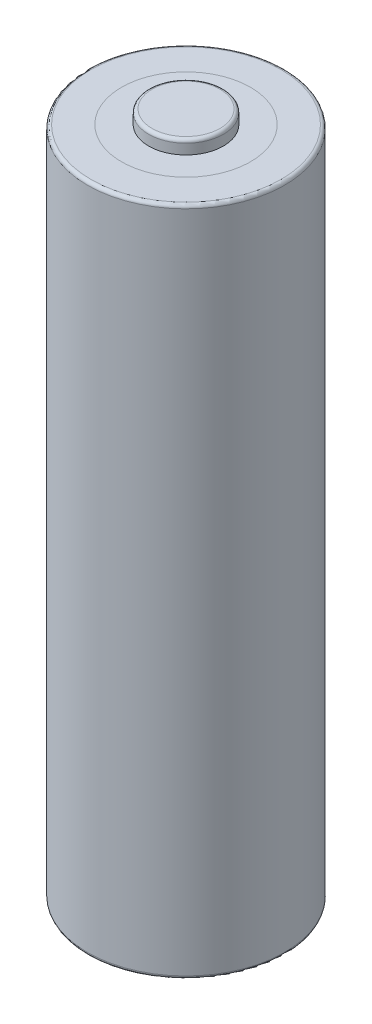
ISO-10303-21;
HEADER;
FILE_DESCRIPTION(('STEP AP214'),'2;1');
FILE_NAME('part.step','',(''),(''),'','','');
FILE_SCHEMA(('AUTOMOTIVE_DESIGN { 1 0 10303 214 1 1 1 1 }'));
ENDSEC;
DATA;
#1=APPLICATION_CONTEXT('core data for automotive mechanical design processes');
#2=APPLICATION_PROTOCOL_DEFINITION('international standard','automotive_design',2000,#1);
#3=PRODUCT_CONTEXT('',#1,'mechanical');
#4=PRODUCT('Part','Part','',(#3));
#5=PRODUCT_RELATED_PRODUCT_CATEGORY('part','',(#4));
#6=PRODUCT_DEFINITION_FORMATION('','',#4);
#7=PRODUCT_DEFINITION_CONTEXT('part definition',#1,'design');
#8=PRODUCT_DEFINITION('design','',#6,#7);
#9=PRODUCT_DEFINITION_SHAPE('','',#8);
#10=(LENGTH_UNIT() NAMED_UNIT(*) SI_UNIT(.MILLI.,.METRE.));
#11=(NAMED_UNIT(*) PLANE_ANGLE_UNIT() SI_UNIT($,.RADIAN.));
#12=(NAMED_UNIT(*) SI_UNIT($,.STERADIAN.) SOLID_ANGLE_UNIT());
#13=UNCERTAINTY_MEASURE_WITH_UNIT(LENGTH_MEASURE(1.E-05),#10,'distance_accuracy_value','');
#14=(GEOMETRIC_REPRESENTATION_CONTEXT(3) GLOBAL_UNCERTAINTY_ASSIGNED_CONTEXT((#13)) GLOBAL_UNIT_ASSIGNED_CONTEXT((#10,
#11,#12)) REPRESENTATION_CONTEXT('',''));
#15=CARTESIAN_POINT('',(0.,0.,0.));
#16=DIRECTION('',(0.,0.,1.));
#17=DIRECTION('',(1.,0.,0.));
#18=AXIS2_PLACEMENT_3D('',#15,#16,#17);
#19=CARTESIAN_POINT('',(0.,0.1,-7.));
#20=DIRECTION('',(0.,1.,0.));
#21=DIRECTION('',(0.,0.,1.));
#22=AXIS2_PLACEMENT_3D('',#19,#20,#21);
#23=PLANE('',#22);
#24=CARTESIAN_POINT('',(0.,0.1,0.));
#25=DIRECTION('',(0.,1.,0.));
#26=DIRECTION('',(0.,0.,1.));
#27=AXIS2_PLACEMENT_3D('',#24,#25,#26);
#28=CIRCLE('',#27,7.);
#29=CARTESIAN_POINT('',(0.,0.1,7.));
#30=VERTEX_POINT('',#29);
#31=EDGE_CURVE('E85',#30,#30,#28,.T.);
#32=ORIENTED_EDGE('',*,*,#31,.F.);
#33=EDGE_LOOP('',(#32));
#34=FACE_BOUND('',#33,.T.);
#35=CARTESIAN_POINT('',(0.,0.100000000000003,0.));
#36=DIRECTION('',(0.,1.,0.));
#37=DIRECTION('',(0.,0.,1.));
#38=AXIS2_PLACEMENT_3D('',#35,#36,#37);
#39=CIRCLE('',#38,4.74999999999999);
#40=CARTESIAN_POINT('',(0.,0.100000000000003,4.74999999999999));
#41=VERTEX_POINT('',#40);
#42=EDGE_CURVE('E12',#41,#41,#39,.F.);
#43=ORIENTED_EDGE('',*,*,#42,.F.);
#44=EDGE_LOOP('',(#43));
#45=FACE_BOUND('',#44,.T.);
#46=ADVANCED_FACE('F51',(#34,#45),#23,.F.);
#47=CARTESIAN_POINT('',(0.,49.5,-2.74999999999999));
#48=DIRECTION('',(0.,-1.,0.));
#49=DIRECTION('',(0.,0.,-1.));
#50=AXIS2_PLACEMENT_3D('',#47,#48,#49);
#51=PLANE('',#50);
#52=CARTESIAN_POINT('',(0.,49.5,0.));
#53=DIRECTION('',(0.,1.,0.));
#54=DIRECTION('',(0.,0.,1.));
#55=AXIS2_PLACEMENT_3D('',#52,#53,#54);
#56=CIRCLE('',#55,6.99999999999999);
#57=CARTESIAN_POINT('',(0.,49.5,6.99999999999999));
#58=VERTEX_POINT('',#57);
#59=EDGE_CURVE('E76',#58,#58,#56,.T.);
#60=ORIENTED_EDGE('',*,*,#59,.T.);
#61=EDGE_LOOP('',(#60));
#62=FACE_BOUND('',#61,.T.);
#63=CARTESIAN_POINT('',(0.,49.5,0.));
#64=DIRECTION('',(0.,-1.,0.));
#65=DIRECTION('',(0.,0.,-1.));
#66=AXIS2_PLACEMENT_3D('',#63,#64,#65);
#67=CIRCLE('',#66,4.74999999999999);
#68=CARTESIAN_POINT('',(0.,49.5,-4.74999999999999));
#69=VERTEX_POINT('',#68);
#70=EDGE_CURVE('E55',#69,#69,#67,.F.);
#71=ORIENTED_EDGE('',*,*,#70,.F.);
#72=EDGE_LOOP('',(#71));
#73=FACE_BOUND('',#72,.T.);
#74=ADVANCED_FACE('F99',(#62,#73),#51,.F.);
#75=CARTESIAN_POINT('',(0.,0.,-3.));
#76=DIRECTION('',(0.,1.,0.));
#77=DIRECTION('',(0.,0.,1.));
#78=AXIS2_PLACEMENT_3D('',#75,#76,#77);
#79=PLANE('',#78);
#80=CARTESIAN_POINT('',(0.,0.,0.));
#81=DIRECTION('',(0.,1.,0.));
#82=DIRECTION('',(0.,0.,1.));
#83=AXIS2_PLACEMENT_3D('',#80,#81,#82);
#84=CIRCLE('',#83,3.);
#85=CARTESIAN_POINT('',(0.,0.,3.));
#86=VERTEX_POINT('',#85);
#87=EDGE_CURVE('E91',#86,#86,#84,.T.);
#88=ORIENTED_EDGE('',*,*,#87,.F.);
#89=EDGE_LOOP('',(#88));
#90=FACE_BOUND('',#89,.T.);
#91=ADVANCED_FACE('F53',(#90),#79,.F.);
#92=CARTESIAN_POINT('',(0.,50.5,0.));
#93=DIRECTION('',(0.,-1.,0.));
#94=DIRECTION('',(0.,0.,-1.));
#95=AXIS2_PLACEMENT_3D('',#92,#93,#94);
#96=PLANE('',#95);
#97=CARTESIAN_POINT('',(0.,50.5,0.));
#98=DIRECTION('',(0.,1.,0.));
#99=DIRECTION('',(0.,0.,1.));
#100=AXIS2_PLACEMENT_3D('',#97,#98,#99);
#101=CIRCLE('',#100,2.49999999999999);
#102=CARTESIAN_POINT('',(0.,50.5,2.49999999999999));
#103=VERTEX_POINT('',#102);
#104=EDGE_CURVE('E66',#103,#103,#101,.T.);
#105=ORIENTED_EDGE('',*,*,#104,.T.);
#106=EDGE_LOOP('',(#105));
#107=FACE_BOUND('',#106,.T.);
#108=ADVANCED_FACE('F98',(#107),#96,.F.);
#109=CARTESIAN_POINT('',(0.,50.25,0.));
#110=DIRECTION('',(0.,1.,0.));
#111=DIRECTION('',(0.,0.,1.));
#112=AXIS2_PLACEMENT_3D('',#109,#110,#111);
#113=TOROIDAL_SURFACE('',#112,2.49999999999999,0.25);
#114=ORIENTED_EDGE('',*,*,#104,.F.);
#115=EDGE_LOOP('',(#114));
#116=FACE_BOUND('',#115,.T.);
#117=CARTESIAN_POINT('',(0.,50.25,0.));
#118=DIRECTION('',(0.,1.,0.));
#119=DIRECTION('',(0.,0.,1.));
#120=AXIS2_PLACEMENT_3D('',#117,#118,#119);
#121=CIRCLE('',#120,2.74999999999999);
#122=CARTESIAN_POINT('',(0.,50.25,2.74999999999999));
#123=VERTEX_POINT('',#122);
#124=EDGE_CURVE('E70',#123,#123,#121,.T.);
#125=ORIENTED_EDGE('',*,*,#124,.T.);
#126=EDGE_LOOP('',(#125));
#127=FACE_BOUND('',#126,.T.);
#128=ADVANCED_FACE('F104',(#116,#127),#113,.T.);
#129=CARTESIAN_POINT('',(0.,0.,0.));
#130=DIRECTION('',(0.,1.,0.));
#131=DIRECTION('',(0.,0.,1.));
#132=AXIS2_PLACEMENT_3D('',#129,#130,#131);
#133=CYLINDRICAL_SURFACE('',#132,2.74999999999999);
#134=ORIENTED_EDGE('',*,*,#124,.F.);
#135=EDGE_LOOP('',(#134));
#136=FACE_BOUND('',#135,.T.);
#137=CARTESIAN_POINT('',(0.,49.5,0.));
#138=DIRECTION('',(0.,1.,0.));
#139=DIRECTION('',(0.,0.,1.));
#140=AXIS2_PLACEMENT_3D('',#137,#138,#139);
#141=CIRCLE('',#140,2.74999999999999);
#142=CARTESIAN_POINT('',(0.,49.5,2.74999999999999));
#143=VERTEX_POINT('',#142);
#144=EDGE_CURVE('E73',#143,#143,#141,.T.);
#145=ORIENTED_EDGE('',*,*,#144,.T.);
#146=EDGE_LOOP('',(#145));
#147=FACE_BOUND('',#146,.T.);
#148=ADVANCED_FACE('F143',(#136,#147),#133,.T.);
#149=ORIENTED_EDGE('',*,*,#70,.T.);
#150=EDGE_LOOP('',(#149));
#151=FACE_BOUND('',#150,.T.);
#152=ORIENTED_EDGE('',*,*,#144,.F.);
#153=EDGE_LOOP('',(#152));
#154=FACE_BOUND('',#153,.T.);
#155=ADVANCED_FACE('F108',(#151,#154),#51,.F.);
#156=CARTESIAN_POINT('',(0.,49.25,0.));
#157=DIRECTION('',(0.,1.,0.));
#158=DIRECTION('',(0.,0.,1.));
#159=AXIS2_PLACEMENT_3D('',#156,#157,#158);
#160=TOROIDAL_SURFACE('',#159,6.99999999999999,0.25);
#161=ORIENTED_EDGE('',*,*,#59,.F.);
#162=EDGE_LOOP('',(#161));
#163=FACE_BOUND('',#162,.T.);
#164=CARTESIAN_POINT('',(0.,49.25,0.));
#165=DIRECTION('',(0.,1.,0.));
#166=DIRECTION('',(0.,0.,1.));
#167=AXIS2_PLACEMENT_3D('',#164,#165,#166);
#168=CIRCLE('',#167,7.25);
#169=CARTESIAN_POINT('',(0.,49.25,7.25));
#170=VERTEX_POINT('',#169);
#171=EDGE_CURVE('E79',#170,#170,#168,.T.);
#172=ORIENTED_EDGE('',*,*,#171,.T.);
#173=EDGE_LOOP('',(#172));
#174=FACE_BOUND('',#173,.T.);
#175=ADVANCED_FACE('F133',(#163,#174),#160,.T.);
#176=CARTESIAN_POINT('',(0.,0.,0.));
#177=DIRECTION('',(0.,1.,0.));
#178=DIRECTION('',(0.,0.,1.));
#179=AXIS2_PLACEMENT_3D('',#176,#177,#178);
#180=CYLINDRICAL_SURFACE('',#179,7.25);
#181=ORIENTED_EDGE('',*,*,#171,.F.);
#182=EDGE_LOOP('',(#181));
#183=FACE_BOUND('',#182,.T.);
#184=CARTESIAN_POINT('',(0.,0.350000000000002,0.));
#185=DIRECTION('',(0.,1.,0.));
#186=DIRECTION('',(0.,0.,1.));
#187=AXIS2_PLACEMENT_3D('',#184,#185,#186);
#188=CIRCLE('',#187,7.25);
#189=CARTESIAN_POINT('',(0.,0.350000000000002,7.25));
#190=VERTEX_POINT('',#189);
#191=EDGE_CURVE('E82',#190,#190,#188,.T.);
#192=ORIENTED_EDGE('',*,*,#191,.T.);
#193=EDGE_LOOP('',(#192));
#194=FACE_BOUND('',#193,.T.);
#195=ADVANCED_FACE('F126',(#183,#194),#180,.T.);
#196=CARTESIAN_POINT('',(0.,0.35,0.));
#197=DIRECTION('',(0.,1.,0.));
#198=DIRECTION('',(0.,0.,1.));
#199=AXIS2_PLACEMENT_3D('',#196,#197,#198);
#200=TOROIDAL_SURFACE('',#199,7.,0.25);
#201=ORIENTED_EDGE('',*,*,#191,.F.);
#202=EDGE_LOOP('',(#201));
#203=FACE_BOUND('',#202,.T.);
#204=ORIENTED_EDGE('',*,*,#31,.T.);
#205=EDGE_LOOP('',(#204));
#206=FACE_BOUND('',#205,.T.);
#207=ADVANCED_FACE('F120',(#203,#206),#200,.T.);
#208=ORIENTED_EDGE('',*,*,#42,.T.);
#209=EDGE_LOOP('',(#208));
#210=FACE_BOUND('',#209,.T.);
#211=CARTESIAN_POINT('',(0.,0.1,0.));
#212=DIRECTION('',(0.,1.,0.));
#213=DIRECTION('',(0.,0.,1.));
#214=AXIS2_PLACEMENT_3D('',#211,#212,#213);
#215=CIRCLE('',#214,3.5);
#216=CARTESIAN_POINT('',(0.,0.1,3.5));
#217=VERTEX_POINT('',#216);
#218=EDGE_CURVE('E88',#217,#217,#215,.T.);
#219=ORIENTED_EDGE('',*,*,#218,.T.);
#220=EDGE_LOOP('',(#219));
#221=FACE_BOUND('',#220,.T.);
#222=ADVANCED_FACE('F112',(#210,#221),#23,.F.);
#223=CARTESIAN_POINT('',(0.,0.,0.));
#224=DIRECTION('',(0.,1.,0.));
#225=DIRECTION('',(0.,0.,1.));
#226=AXIS2_PLACEMENT_3D('',#223,#224,#225);
#227=CONICAL_SURFACE('',#226,3.,1.37340076694502);
#228=ORIENTED_EDGE('',*,*,#218,.F.);
#229=EDGE_LOOP('',(#228));
#230=FACE_BOUND('',#229,.T.);
#231=ORIENTED_EDGE('',*,*,#87,.T.);
#232=EDGE_LOOP('',(#231));
#233=FACE_BOUND('',#232,.T.);
#234=ADVANCED_FACE('F95',(#230,#233),#227,.T.);
#235=CLOSED_SHELL('',(#46,#74,#91,#108,#128,#148,#155,#175,#195,#207,#222,#234));
#236=MANIFOLD_SOLID_BREP('B2',#235);
#237=ADVANCED_BREP_SHAPE_REPRESENTATION('',(#18,#236),#14);
#238=SHAPE_DEFINITION_REPRESENTATION(#9,#237);
ENDSEC;
END-ISO-10303-21;
